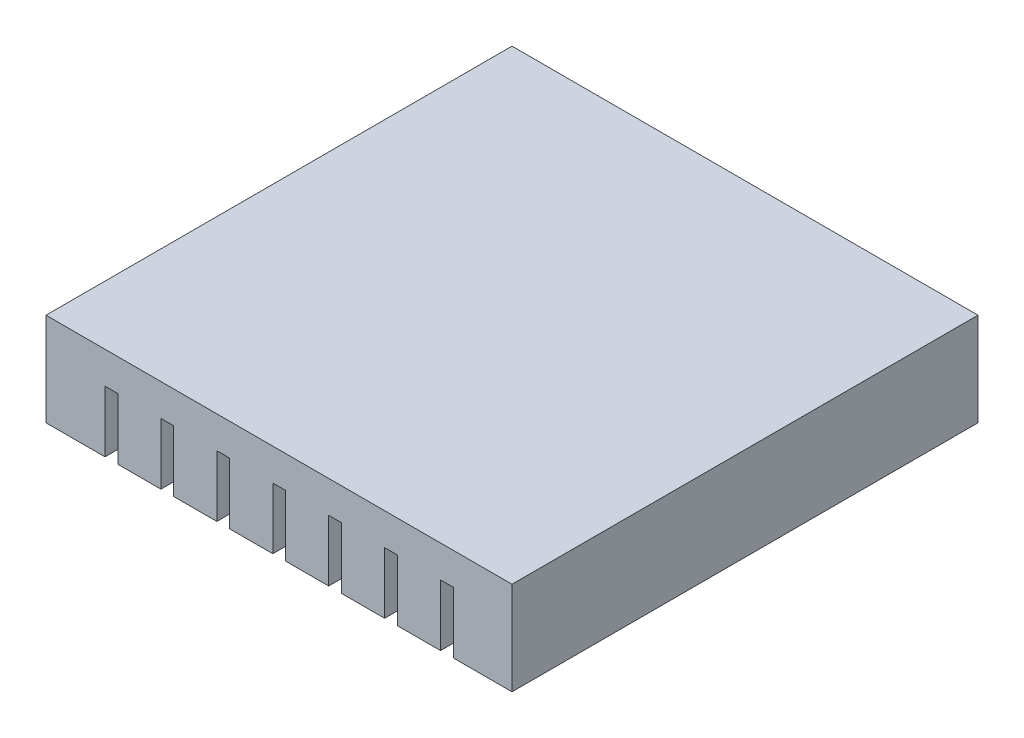
ISO-10303-21;
HEADER;
FILE_DESCRIPTION(('STEP AP214'),'2;1');
FILE_NAME('part.step','',(''),(''),'','','');
FILE_SCHEMA(('AUTOMOTIVE_DESIGN { 1 0 10303 214 1 1 1 1 }'));
ENDSEC;
DATA;
#1=APPLICATION_CONTEXT('core data for automotive mechanical design processes');
#2=APPLICATION_PROTOCOL_DEFINITION('international standard','automotive_design',2000,#1);
#3=PRODUCT_CONTEXT('',#1,'mechanical');
#4=PRODUCT('Part','Part','',(#3));
#5=PRODUCT_RELATED_PRODUCT_CATEGORY('part','',(#4));
#6=PRODUCT_DEFINITION_FORMATION('','',#4);
#7=PRODUCT_DEFINITION_CONTEXT('part definition',#1,'design');
#8=PRODUCT_DEFINITION('design','',#6,#7);
#9=PRODUCT_DEFINITION_SHAPE('','',#8);
#10=(LENGTH_UNIT() NAMED_UNIT(*) SI_UNIT(.MILLI.,.METRE.));
#11=(NAMED_UNIT(*) PLANE_ANGLE_UNIT() SI_UNIT($,.RADIAN.));
#12=(NAMED_UNIT(*) SI_UNIT($,.STERADIAN.) SOLID_ANGLE_UNIT());
#13=UNCERTAINTY_MEASURE_WITH_UNIT(LENGTH_MEASURE(1.E-05),#10,'distance_accuracy_value','');
#14=(GEOMETRIC_REPRESENTATION_CONTEXT(3) GLOBAL_UNCERTAINTY_ASSIGNED_CONTEXT((#13)) GLOBAL_UNIT_ASSIGNED_CONTEXT((#10,
#11,#12)) REPRESENTATION_CONTEXT('',''));
#15=CARTESIAN_POINT('',(0.,0.,0.));
#16=DIRECTION('',(0.,0.,1.));
#17=DIRECTION('',(1.,0.,0.));
#18=AXIS2_PLACEMENT_3D('',#15,#16,#17);
#19=CARTESIAN_POINT('',(0.,0.,0.));
#20=DIRECTION('',(0.,1.,0.));
#21=DIRECTION('',(0.,0.,1.));
#22=AXIS2_PLACEMENT_3D('',#19,#20,#21);
#23=PLANE('',#22);
#24=DIRECTION('',(-1.,0.,0.));
#25=VECTOR('',#24,1.);
#26=CARTESIAN_POINT('',(0.,0.,0.));
#27=LINE('',#26,#25);
#28=CARTESIAN_POINT('',(12.3309619154796,0.,0.));
#29=VERTEX_POINT('',#28);
#30=CARTESIAN_POINT('',(7.70096191547959,0.,0.));
#31=VERTEX_POINT('',#30);
#32=EDGE_CURVE('E262',#29,#31,#27,.T.);
#33=ORIENTED_EDGE('',*,*,#32,.F.);
#34=DIRECTION('',(0.,0.,1.));
#35=VECTOR('',#34,1.);
#36=CARTESIAN_POINT('',(12.3309619154796,0.,-6.71010906606882));
#37=LINE('',#36,#35);
#38=CARTESIAN_POINT('',(12.3309619154796,0.,50.));
#39=VERTEX_POINT('',#38);
#40=EDGE_CURVE('E246',#29,#39,#37,.T.);
#41=ORIENTED_EDGE('',*,*,#40,.T.);
#42=DIRECTION('',(1.,0.,0.));
#43=VECTOR('',#42,1.);
#44=CARTESIAN_POINT('',(0.,0.,50.));
#45=LINE('',#44,#43);
#46=CARTESIAN_POINT('',(7.70096191547959,0.,50.));
#47=VERTEX_POINT('',#46);
#48=EDGE_CURVE('E261',#47,#39,#45,.T.);
#49=ORIENTED_EDGE('',*,*,#48,.F.);
#50=DIRECTION('',(0.,0.,1.));
#51=VECTOR('',#50,1.);
#52=CARTESIAN_POINT('',(7.70096191547959,0.,-6.71010906606882));
#53=LINE('',#52,#51);
#54=EDGE_CURVE('E329',#31,#47,#53,.T.);
#55=ORIENTED_EDGE('',*,*,#54,.F.);
#56=EDGE_LOOP('',(#33,#41,#49,#55));
#57=FACE_BOUND('',#56,.T.);
#58=ADVANCED_FACE('F33',(#57),#23,.F.);
#59=CARTESIAN_POINT('',(13.7009619154796,0.,50.));
#60=VERTEX_POINT('',#59);
#61=CARTESIAN_POINT('',(18.3309619154796,0.,50.));
#62=VERTEX_POINT('',#61);
#63=EDGE_CURVE('E272',#60,#62,#45,.T.);
#64=ORIENTED_EDGE('',*,*,#63,.F.);
#65=DIRECTION('',(0.,0.,1.));
#66=VECTOR('',#65,1.);
#67=CARTESIAN_POINT('',(13.7009619154796,0.,-6.71010906606882));
#68=LINE('',#67,#66);
#69=CARTESIAN_POINT('',(13.7009619154796,0.,0.));
#70=VERTEX_POINT('',#69);
#71=EDGE_CURVE('E263',#70,#60,#68,.T.);
#72=ORIENTED_EDGE('',*,*,#71,.F.);
#73=CARTESIAN_POINT('',(18.3309619154796,0.,0.));
#74=VERTEX_POINT('',#73);
#75=EDGE_CURVE('E477',#74,#70,#27,.T.);
#76=ORIENTED_EDGE('',*,*,#75,.F.);
#77=DIRECTION('',(0.,0.,1.));
#78=VECTOR('',#77,1.);
#79=CARTESIAN_POINT('',(18.3309619154796,0.,-6.71010906606882));
#80=LINE('',#79,#78);
#81=EDGE_CURVE('E440',#74,#62,#80,.T.);
#82=ORIENTED_EDGE('',*,*,#81,.T.);
#83=EDGE_LOOP('',(#64,#72,#76,#82));
#84=FACE_BOUND('',#83,.T.);
#85=ADVANCED_FACE('F534',(#84),#23,.F.);
#86=CARTESIAN_POINT('',(19.7009619154796,0.,50.));
#87=VERTEX_POINT('',#86);
#88=CARTESIAN_POINT('',(24.3309619154796,0.,50.));
#89=VERTEX_POINT('',#88);
#90=EDGE_CURVE('E278',#87,#89,#45,.T.);
#91=ORIENTED_EDGE('',*,*,#90,.F.);
#92=DIRECTION('',(0.,0.,1.));
#93=VECTOR('',#92,1.);
#94=CARTESIAN_POINT('',(19.7009619154796,0.,-6.71010906606882));
#95=LINE('',#94,#93);
#96=CARTESIAN_POINT('',(19.7009619154796,0.,0.));
#97=VERTEX_POINT('',#96);
#98=EDGE_CURVE('E443',#97,#87,#95,.T.);
#99=ORIENTED_EDGE('',*,*,#98,.F.);
#100=CARTESIAN_POINT('',(24.3309619154796,0.,0.));
#101=VERTEX_POINT('',#100);
#102=EDGE_CURVE('E480',#101,#97,#27,.T.);
#103=ORIENTED_EDGE('',*,*,#102,.F.);
#104=DIRECTION('',(0.,0.,1.));
#105=VECTOR('',#104,1.);
#106=CARTESIAN_POINT('',(24.3309619154796,0.,-6.71010906606882));
#107=LINE('',#106,#105);
#108=EDGE_CURVE('E417',#101,#89,#107,.T.);
#109=ORIENTED_EDGE('',*,*,#108,.T.);
#110=EDGE_LOOP('',(#91,#99,#103,#109));
#111=FACE_BOUND('',#110,.T.);
#112=ADVANCED_FACE('F523',(#111),#23,.F.);
#113=CARTESIAN_POINT('',(25.7009619154796,0.,50.));
#114=VERTEX_POINT('',#113);
#115=CARTESIAN_POINT('',(30.3309619154796,0.,50.));
#116=VERTEX_POINT('',#115);
#117=EDGE_CURVE('E506',#114,#116,#45,.T.);
#118=ORIENTED_EDGE('',*,*,#117,.F.);
#119=DIRECTION('',(0.,0.,1.));
#120=VECTOR('',#119,1.);
#121=CARTESIAN_POINT('',(25.7009619154796,0.,-6.71010906606882));
#122=LINE('',#121,#120);
#123=CARTESIAN_POINT('',(25.7009619154796,0.,0.));
#124=VERTEX_POINT('',#123);
#125=EDGE_CURVE('E420',#124,#114,#122,.T.);
#126=ORIENTED_EDGE('',*,*,#125,.F.);
#127=CARTESIAN_POINT('',(30.3309619154796,0.,0.));
#128=VERTEX_POINT('',#127);
#129=EDGE_CURVE('E482',#128,#124,#27,.T.);
#130=ORIENTED_EDGE('',*,*,#129,.F.);
#131=DIRECTION('',(0.,0.,1.));
#132=VECTOR('',#131,1.);
#133=CARTESIAN_POINT('',(30.3309619154796,0.,-6.71010906606882));
#134=LINE('',#133,#132);
#135=EDGE_CURVE('E394',#128,#116,#134,.T.);
#136=ORIENTED_EDGE('',*,*,#135,.T.);
#137=EDGE_LOOP('',(#118,#126,#130,#136));
#138=FACE_BOUND('',#137,.T.);
#139=ADVANCED_FACE('F504',(#138),#23,.F.);
#140=CARTESIAN_POINT('',(31.7009619154796,0.,50.));
#141=VERTEX_POINT('',#140);
#142=CARTESIAN_POINT('',(36.3309619154796,0.,50.));
#143=VERTEX_POINT('',#142);
#144=EDGE_CURVE('E567',#141,#143,#45,.T.);
#145=ORIENTED_EDGE('',*,*,#144,.F.);
#146=DIRECTION('',(0.,0.,1.));
#147=VECTOR('',#146,1.);
#148=CARTESIAN_POINT('',(31.7009619154796,0.,-6.71010906606882));
#149=LINE('',#148,#147);
#150=CARTESIAN_POINT('',(31.7009619154796,0.,0.));
#151=VERTEX_POINT('',#150);
#152=EDGE_CURVE('E397',#151,#141,#149,.T.);
#153=ORIENTED_EDGE('',*,*,#152,.F.);
#154=CARTESIAN_POINT('',(36.3309619154796,0.,0.));
#155=VERTEX_POINT('',#154);
#156=EDGE_CURVE('E487',#155,#151,#27,.T.);
#157=ORIENTED_EDGE('',*,*,#156,.F.);
#158=DIRECTION('',(0.,0.,1.));
#159=VECTOR('',#158,1.);
#160=CARTESIAN_POINT('',(36.3309619154796,0.,-6.71010906606882));
#161=LINE('',#160,#159);
#162=EDGE_CURVE('E371',#155,#143,#161,.T.);
#163=ORIENTED_EDGE('',*,*,#162,.T.);
#164=EDGE_LOOP('',(#145,#153,#157,#163));
#165=FACE_BOUND('',#164,.T.);
#166=ADVANCED_FACE('F579',(#165),#23,.F.);
#167=CARTESIAN_POINT('',(37.7009619154796,0.,50.));
#168=VERTEX_POINT('',#167);
#169=CARTESIAN_POINT('',(42.3309619154796,0.,50.));
#170=VERTEX_POINT('',#169);
#171=EDGE_CURVE('E564',#168,#170,#45,.T.);
#172=ORIENTED_EDGE('',*,*,#171,.F.);
#173=DIRECTION('',(0.,0.,1.));
#174=VECTOR('',#173,1.);
#175=CARTESIAN_POINT('',(37.7009619154796,0.,-6.71010906606882));
#176=LINE('',#175,#174);
#177=CARTESIAN_POINT('',(37.7009619154796,0.,0.));
#178=VERTEX_POINT('',#177);
#179=EDGE_CURVE('E374',#178,#168,#176,.T.);
#180=ORIENTED_EDGE('',*,*,#179,.F.);
#181=CARTESIAN_POINT('',(42.3309619154796,0.,0.));
#182=VERTEX_POINT('',#181);
#183=EDGE_CURVE('E289',#182,#178,#27,.T.);
#184=ORIENTED_EDGE('',*,*,#183,.F.);
#185=DIRECTION('',(0.,0.,1.));
#186=VECTOR('',#185,1.);
#187=CARTESIAN_POINT('',(42.3309619154796,0.,-6.71010906606882));
#188=LINE('',#187,#186);
#189=EDGE_CURVE('E349',#182,#170,#188,.T.);
#190=ORIENTED_EDGE('',*,*,#189,.T.);
#191=EDGE_LOOP('',(#172,#180,#184,#190));
#192=FACE_BOUND('',#191,.T.);
#193=ADVANCED_FACE('F559',(#192),#23,.F.);
#194=CARTESIAN_POINT('',(6.33096191547959,0.,0.));
#195=VERTEX_POINT('',#194);
#196=CARTESIAN_POINT('',(0.,0.,0.));
#197=VERTEX_POINT('',#196);
#198=EDGE_CURVE('E284',#195,#197,#27,.T.);
#199=ORIENTED_EDGE('',*,*,#198,.F.);
#200=DIRECTION('',(0.,0.,1.));
#201=VECTOR('',#200,1.);
#202=CARTESIAN_POINT('',(6.33096191547959,0.,-6.71010906606882));
#203=LINE('',#202,#201);
#204=CARTESIAN_POINT('',(6.33096191547959,0.,50.));
#205=VERTEX_POINT('',#204);
#206=EDGE_CURVE('E326',#195,#205,#203,.T.);
#207=ORIENTED_EDGE('',*,*,#206,.T.);
#208=CARTESIAN_POINT('',(0.,0.,50.));
#209=VERTEX_POINT('',#208);
#210=EDGE_CURVE('E271',#209,#205,#45,.T.);
#211=ORIENTED_EDGE('',*,*,#210,.F.);
#212=DIRECTION('',(0.,0.,1.));
#213=VECTOR('',#212,1.);
#214=CARTESIAN_POINT('',(0.,0.,0.));
#215=LINE('',#214,#213);
#216=EDGE_CURVE('E281',#197,#209,#215,.T.);
#217=ORIENTED_EDGE('',*,*,#216,.F.);
#218=EDGE_LOOP('',(#199,#207,#211,#217));
#219=FACE_BOUND('',#218,.T.);
#220=ADVANCED_FACE('F546',(#219),#23,.F.);
#221=CARTESIAN_POINT('',(0.,10.,0.));
#222=DIRECTION('',(1.,0.,0.));
#223=DIRECTION('',(0.,0.,-1.));
#224=AXIS2_PLACEMENT_3D('',#221,#222,#223);
#225=PLANE('',#224);
#226=ORIENTED_EDGE('',*,*,#216,.T.);
#227=DIRECTION('',(0.,-1.,0.));
#228=VECTOR('',#227,1.);
#229=CARTESIAN_POINT('',(0.,10.,50.));
#230=LINE('',#229,#228);
#231=CARTESIAN_POINT('',(0.,10.,50.));
#232=VERTEX_POINT('',#231);
#233=EDGE_CURVE('E11',#232,#209,#230,.T.);
#234=ORIENTED_EDGE('',*,*,#233,.F.);
#235=DIRECTION('',(0.,0.,1.));
#236=VECTOR('',#235,1.);
#237=CARTESIAN_POINT('',(0.,10.,0.));
#238=LINE('',#237,#236);
#239=CARTESIAN_POINT('',(0.,10.,0.));
#240=VERTEX_POINT('',#239);
#241=EDGE_CURVE('E288',#240,#232,#238,.T.);
#242=ORIENTED_EDGE('',*,*,#241,.F.);
#243=DIRECTION('',(0.,-1.,0.));
#244=VECTOR('',#243,1.);
#245=CARTESIAN_POINT('',(0.,10.,0.));
#246=LINE('',#245,#244);
#247=EDGE_CURVE('E290',#240,#197,#246,.T.);
#248=ORIENTED_EDGE('',*,*,#247,.T.);
#249=EDGE_LOOP('',(#226,#234,#242,#248));
#250=FACE_BOUND('',#249,.T.);
#251=ADVANCED_FACE('F35',(#250),#225,.F.);
#252=CARTESIAN_POINT('',(0.,10.,50.));
#253=DIRECTION('',(0.,0.,-1.));
#254=DIRECTION('',(-1.,0.,0.));
#255=AXIS2_PLACEMENT_3D('',#252,#253,#254);
#256=PLANE('',#255);
#257=ORIENTED_EDGE('',*,*,#48,.T.);
#258=DIRECTION('',(0.,-1.,0.));
#259=VECTOR('',#258,1.);
#260=CARTESIAN_POINT('',(12.3309619154796,0.,50.));
#261=LINE('',#260,#259);
#262=CARTESIAN_POINT('',(12.3309619154796,6.56876424288001,50.));
#263=VERTEX_POINT('',#262);
#264=EDGE_CURVE('E243',#263,#39,#261,.T.);
#265=ORIENTED_EDGE('',*,*,#264,.F.);
#266=DIRECTION('',(-1.,0.,0.));
#267=VECTOR('',#266,1.);
#268=CARTESIAN_POINT('',(12.3309619154796,6.56876424288001,50.));
#269=LINE('',#268,#267);
#270=CARTESIAN_POINT('',(13.7009619154796,6.56876424288001,50.));
#271=VERTEX_POINT('',#270);
#272=EDGE_CURVE('E264',#271,#263,#269,.T.);
#273=ORIENTED_EDGE('',*,*,#272,.F.);
#274=DIRECTION('',(0.,1.,0.));
#275=VECTOR('',#274,1.);
#276=CARTESIAN_POINT('',(13.7009619154796,0.,50.));
#277=LINE('',#276,#275);
#278=EDGE_CURVE('E254',#60,#271,#277,.T.);
#279=ORIENTED_EDGE('',*,*,#278,.F.);
#280=ORIENTED_EDGE('',*,*,#63,.T.);
#281=DIRECTION('',(0.,-1.,0.));
#282=VECTOR('',#281,1.);
#283=CARTESIAN_POINT('',(18.3309619154796,0.,50.));
#284=LINE('',#283,#282);
#285=CARTESIAN_POINT('',(18.3309619154796,6.56876424288001,50.));
#286=VERTEX_POINT('',#285);
#287=EDGE_CURVE('E436',#286,#62,#284,.T.);
#288=ORIENTED_EDGE('',*,*,#287,.F.);
#289=DIRECTION('',(-1.,0.,0.));
#290=VECTOR('',#289,1.);
#291=CARTESIAN_POINT('',(18.3309619154796,6.56876424288001,50.));
#292=LINE('',#291,#290);
#293=CARTESIAN_POINT('',(19.7009619154796,6.56876424288001,50.));
#294=VERTEX_POINT('',#293);
#295=EDGE_CURVE('E444',#294,#286,#292,.T.);
#296=ORIENTED_EDGE('',*,*,#295,.F.);
#297=DIRECTION('',(0.,1.,0.));
#298=VECTOR('',#297,1.);
#299=CARTESIAN_POINT('',(19.7009619154796,0.,50.));
#300=LINE('',#299,#298);
#301=EDGE_CURVE('E452',#87,#294,#300,.T.);
#302=ORIENTED_EDGE('',*,*,#301,.F.);
#303=ORIENTED_EDGE('',*,*,#90,.T.);
#304=DIRECTION('',(0.,-1.,0.));
#305=VECTOR('',#304,1.);
#306=CARTESIAN_POINT('',(24.3309619154796,0.,50.));
#307=LINE('',#306,#305);
#308=CARTESIAN_POINT('',(24.3309619154796,6.56876424288001,50.));
#309=VERTEX_POINT('',#308);
#310=EDGE_CURVE('E413',#309,#89,#307,.T.);
#311=ORIENTED_EDGE('',*,*,#310,.F.);
#312=DIRECTION('',(-1.,0.,0.));
#313=VECTOR('',#312,1.);
#314=CARTESIAN_POINT('',(24.3309619154796,6.56876424288001,50.));
#315=LINE('',#314,#313);
#316=CARTESIAN_POINT('',(25.7009619154796,6.56876424288001,50.));
#317=VERTEX_POINT('',#316);
#318=EDGE_CURVE('E421',#317,#309,#315,.T.);
#319=ORIENTED_EDGE('',*,*,#318,.F.);
#320=DIRECTION('',(0.,1.,0.));
#321=VECTOR('',#320,1.);
#322=CARTESIAN_POINT('',(25.7009619154796,0.,50.));
#323=LINE('',#322,#321);
#324=EDGE_CURVE('E430',#114,#317,#323,.T.);
#325=ORIENTED_EDGE('',*,*,#324,.F.);
#326=ORIENTED_EDGE('',*,*,#117,.T.);
#327=DIRECTION('',(0.,-1.,0.));
#328=VECTOR('',#327,1.);
#329=CARTESIAN_POINT('',(30.3309619154796,0.,50.));
#330=LINE('',#329,#328);
#331=CARTESIAN_POINT('',(30.3309619154796,6.56876424288001,50.));
#332=VERTEX_POINT('',#331);
#333=EDGE_CURVE('E390',#332,#116,#330,.T.);
#334=ORIENTED_EDGE('',*,*,#333,.F.);
#335=DIRECTION('',(-1.,0.,0.));
#336=VECTOR('',#335,1.);
#337=CARTESIAN_POINT('',(30.3309619154796,6.56876424288001,50.));
#338=LINE('',#337,#336);
#339=CARTESIAN_POINT('',(31.7009619154796,6.56876424288001,50.));
#340=VERTEX_POINT('',#339);
#341=EDGE_CURVE('E398',#340,#332,#338,.T.);
#342=ORIENTED_EDGE('',*,*,#341,.F.);
#343=DIRECTION('',(0.,1.,0.));
#344=VECTOR('',#343,1.);
#345=CARTESIAN_POINT('',(31.7009619154796,0.,50.));
#346=LINE('',#345,#344);
#347=EDGE_CURVE('E407',#141,#340,#346,.T.);
#348=ORIENTED_EDGE('',*,*,#347,.F.);
#349=ORIENTED_EDGE('',*,*,#144,.T.);
#350=DIRECTION('',(0.,-1.,0.));
#351=VECTOR('',#350,1.);
#352=CARTESIAN_POINT('',(36.3309619154796,0.,50.));
#353=LINE('',#352,#351);
#354=CARTESIAN_POINT('',(36.3309619154796,6.56876424288001,50.));
#355=VERTEX_POINT('',#354);
#356=EDGE_CURVE('E367',#355,#143,#353,.T.);
#357=ORIENTED_EDGE('',*,*,#356,.F.);
#358=DIRECTION('',(-1.,0.,0.));
#359=VECTOR('',#358,1.);
#360=CARTESIAN_POINT('',(36.3309619154796,6.56876424288001,50.));
#361=LINE('',#360,#359);
#362=CARTESIAN_POINT('',(37.7009619154796,6.56876424288001,50.));
#363=VERTEX_POINT('',#362);
#364=EDGE_CURVE('E375',#363,#355,#361,.T.);
#365=ORIENTED_EDGE('',*,*,#364,.F.);
#366=DIRECTION('',(0.,1.,0.));
#367=VECTOR('',#366,1.);
#368=CARTESIAN_POINT('',(37.7009619154796,0.,50.));
#369=LINE('',#368,#367);
#370=EDGE_CURVE('E384',#168,#363,#369,.T.);
#371=ORIENTED_EDGE('',*,*,#370,.F.);
#372=ORIENTED_EDGE('',*,*,#171,.T.);
#373=DIRECTION('',(0.,-1.,0.));
#374=VECTOR('',#373,1.);
#375=CARTESIAN_POINT('',(42.3309619154796,0.,50.));
#376=LINE('',#375,#374);
#377=CARTESIAN_POINT('',(42.3309619154796,6.56876424288001,50.));
#378=VERTEX_POINT('',#377);
#379=EDGE_CURVE('E363',#378,#170,#376,.T.);
#380=ORIENTED_EDGE('',*,*,#379,.F.);
#381=DIRECTION('',(-1.,0.,0.));
#382=VECTOR('',#381,1.);
#383=CARTESIAN_POINT('',(42.3309619154796,6.56876424288001,50.));
#384=LINE('',#383,#382);
#385=CARTESIAN_POINT('',(43.7009619154796,6.56876424288001,50.));
#386=VERTEX_POINT('',#385);
#387=EDGE_CURVE('E352',#386,#378,#384,.T.);
#388=ORIENTED_EDGE('',*,*,#387,.F.);
#389=DIRECTION('',(0.,1.,0.));
#390=VECTOR('',#389,1.);
#391=CARTESIAN_POINT('',(43.7009619154796,0.,50.));
#392=LINE('',#391,#390);
#393=CARTESIAN_POINT('',(43.7009619154796,0.,50.));
#394=VERTEX_POINT('',#393);
#395=EDGE_CURVE('E360',#394,#386,#392,.T.);
#396=ORIENTED_EDGE('',*,*,#395,.F.);
#397=CARTESIAN_POINT('',(50.,0.,50.));
#398=VERTEX_POINT('',#397);
#399=EDGE_CURVE('E276',#394,#398,#45,.T.);
#400=ORIENTED_EDGE('',*,*,#399,.T.);
#401=DIRECTION('',(0.,-1.,0.));
#402=VECTOR('',#401,1.);
#403=CARTESIAN_POINT('',(50.,10.,50.));
#404=LINE('',#403,#402);
#405=CARTESIAN_POINT('',(50.,10.,50.));
#406=VERTEX_POINT('',#405);
#407=EDGE_CURVE('E41',#406,#398,#404,.T.);
#408=ORIENTED_EDGE('',*,*,#407,.F.);
#409=DIRECTION('',(1.,0.,0.));
#410=VECTOR('',#409,1.);
#411=CARTESIAN_POINT('',(0.,10.,50.));
#412=LINE('',#411,#410);
#413=EDGE_CURVE('E321',#232,#406,#412,.T.);
#414=ORIENTED_EDGE('',*,*,#413,.F.);
#415=ORIENTED_EDGE('',*,*,#233,.T.);
#416=ORIENTED_EDGE('',*,*,#210,.T.);
#417=DIRECTION('',(0.,-1.,0.));
#418=VECTOR('',#417,1.);
#419=CARTESIAN_POINT('',(6.33096191547959,0.,50.));
#420=LINE('',#419,#418);
#421=CARTESIAN_POINT('',(6.33096191547959,6.56876424288001,50.));
#422=VERTEX_POINT('',#421);
#423=EDGE_CURVE('E340',#422,#205,#420,.T.);
#424=ORIENTED_EDGE('',*,*,#423,.F.);
#425=DIRECTION('',(-1.,0.,0.));
#426=VECTOR('',#425,1.);
#427=CARTESIAN_POINT('',(6.33096191547959,6.56876424288001,50.));
#428=LINE('',#427,#426);
#429=CARTESIAN_POINT('',(7.70096191547959,6.56876424288001,50.));
#430=VERTEX_POINT('',#429);
#431=EDGE_CURVE('E330',#430,#422,#428,.T.);
#432=ORIENTED_EDGE('',*,*,#431,.F.);
#433=DIRECTION('',(0.,1.,0.));
#434=VECTOR('',#433,1.);
#435=CARTESIAN_POINT('',(7.70096191547959,0.,50.));
#436=LINE('',#435,#434);
#437=EDGE_CURVE('E270',#47,#430,#436,.T.);
#438=ORIENTED_EDGE('',*,*,#437,.F.);
#439=EDGE_LOOP('',(#257,#265,#273,#279,#280,#288,#296,#302,#303,#311,#319,#325,#326,#334,#342,
#348,#349,#357,#365,#371,#372,#380,#388,#396,#400,#408,#414,#415,#416,#424,#432,#438));
#440=FACE_BOUND('',#439,.T.);
#441=ADVANCED_FACE('F267',(#440),#256,.F.);
#442=CARTESIAN_POINT('',(50.,10.,0.));
#443=DIRECTION('',(-1.,0.,0.));
#444=DIRECTION('',(0.,0.,1.));
#445=AXIS2_PLACEMENT_3D('',#442,#443,#444);
#446=PLANE('',#445);
#447=DIRECTION('',(0.,0.,-1.));
#448=VECTOR('',#447,1.);
#449=CARTESIAN_POINT('',(50.,0.,0.));
#450=LINE('',#449,#448);
#451=CARTESIAN_POINT('',(50.,0.,0.));
#452=VERTEX_POINT('',#451);
#453=EDGE_CURVE('E275',#398,#452,#450,.T.);
#454=ORIENTED_EDGE('',*,*,#453,.T.);
#455=DIRECTION('',(0.,-1.,0.));
#456=VECTOR('',#455,1.);
#457=CARTESIAN_POINT('',(50.,10.,0.));
#458=LINE('',#457,#456);
#459=CARTESIAN_POINT('',(50.,10.,0.));
#460=VERTEX_POINT('',#459);
#461=EDGE_CURVE('E293',#460,#452,#458,.T.);
#462=ORIENTED_EDGE('',*,*,#461,.F.);
#463=DIRECTION('',(0.,0.,-1.));
#464=VECTOR('',#463,1.);
#465=CARTESIAN_POINT('',(50.,10.,0.));
#466=LINE('',#465,#464);
#467=EDGE_CURVE('E303',#406,#460,#466,.T.);
#468=ORIENTED_EDGE('',*,*,#467,.F.);
#469=ORIENTED_EDGE('',*,*,#407,.T.);
#470=EDGE_LOOP('',(#454,#462,#468,#469));
#471=FACE_BOUND('',#470,.T.);
#472=ADVANCED_FACE('F301',(#471),#446,.F.);
#473=CARTESIAN_POINT('',(0.,10.,0.));
#474=DIRECTION('',(0.,0.,1.));
#475=DIRECTION('',(1.,0.,0.));
#476=AXIS2_PLACEMENT_3D('',#473,#474,#475);
#477=PLANE('',#476);
#478=DIRECTION('',(1.,0.,0.));
#479=VECTOR('',#478,1.);
#480=CARTESIAN_POINT('',(12.3309619154796,6.56876424288001,0.));
#481=LINE('',#480,#479);
#482=CARTESIAN_POINT('',(12.3309619154796,6.56876424288001,0.));
#483=VERTEX_POINT('',#482);
#484=CARTESIAN_POINT('',(13.7009619154796,6.56876424288001,0.));
#485=VERTEX_POINT('',#484);
#486=EDGE_CURVE('E468',#483,#485,#481,.T.);
#487=ORIENTED_EDGE('',*,*,#486,.F.);
#488=DIRECTION('',(0.,1.,0.));
#489=VECTOR('',#488,1.);
#490=CARTESIAN_POINT('',(12.3309619154796,0.,0.));
#491=LINE('',#490,#489);
#492=EDGE_CURVE('E342',#29,#483,#491,.T.);
#493=ORIENTED_EDGE('',*,*,#492,.F.);
#494=ORIENTED_EDGE('',*,*,#32,.T.);
#495=DIRECTION('',(0.,-1.,0.));
#496=VECTOR('',#495,1.);
#497=CARTESIAN_POINT('',(7.70096191547959,0.,0.));
#498=LINE('',#497,#496);
#499=CARTESIAN_POINT('',(7.70096191547959,6.56876424288001,0.));
#500=VERTEX_POINT('',#499);
#501=EDGE_CURVE('E336',#500,#31,#498,.T.);
#502=ORIENTED_EDGE('',*,*,#501,.F.);
#503=DIRECTION('',(1.,0.,0.));
#504=VECTOR('',#503,1.);
#505=CARTESIAN_POINT('',(6.33096191547959,6.56876424288001,0.));
#506=LINE('',#505,#504);
#507=CARTESIAN_POINT('',(6.33096191547959,6.56876424288001,0.));
#508=VERTEX_POINT('',#507);
#509=EDGE_CURVE('E345',#508,#500,#506,.T.);
#510=ORIENTED_EDGE('',*,*,#509,.F.);
#511=DIRECTION('',(0.,1.,0.));
#512=VECTOR('',#511,1.);
#513=CARTESIAN_POINT('',(6.33096191547959,0.,0.));
#514=LINE('',#513,#512);
#515=EDGE_CURVE('E343',#195,#508,#514,.T.);
#516=ORIENTED_EDGE('',*,*,#515,.F.);
#517=ORIENTED_EDGE('',*,*,#198,.T.);
#518=ORIENTED_EDGE('',*,*,#247,.F.);
#519=DIRECTION('',(-1.,0.,0.));
#520=VECTOR('',#519,1.);
#521=CARTESIAN_POINT('',(0.,10.,0.));
#522=LINE('',#521,#520);
#523=EDGE_CURVE('E294',#460,#240,#522,.T.);
#524=ORIENTED_EDGE('',*,*,#523,.F.);
#525=ORIENTED_EDGE('',*,*,#461,.T.);
#526=CARTESIAN_POINT('',(43.7009619154796,0.,0.));
#527=VERTEX_POINT('',#526);
#528=EDGE_CURVE('E285',#452,#527,#27,.T.);
#529=ORIENTED_EDGE('',*,*,#528,.T.);
#530=DIRECTION('',(0.,-1.,0.));
#531=VECTOR('',#530,1.);
#532=CARTESIAN_POINT('',(43.7009619154796,0.,0.));
#533=LINE('',#532,#531);
#534=CARTESIAN_POINT('',(43.7009619154796,6.56876424288001,0.));
#535=VERTEX_POINT('',#534);
#536=EDGE_CURVE('E315',#535,#527,#533,.T.);
#537=ORIENTED_EDGE('',*,*,#536,.F.);
#538=DIRECTION('',(1.,0.,0.));
#539=VECTOR('',#538,1.);
#540=CARTESIAN_POINT('',(42.3309619154796,6.56876424288001,0.));
#541=LINE('',#540,#539);
#542=CARTESIAN_POINT('',(42.3309619154796,6.56876424288001,0.));
#543=VERTEX_POINT('',#542);
#544=EDGE_CURVE('E368',#543,#535,#541,.T.);
#545=ORIENTED_EDGE('',*,*,#544,.F.);
#546=DIRECTION('',(0.,1.,0.));
#547=VECTOR('',#546,1.);
#548=CARTESIAN_POINT('',(42.3309619154796,0.,0.));
#549=LINE('',#548,#547);
#550=EDGE_CURVE('E365',#182,#543,#549,.T.);
#551=ORIENTED_EDGE('',*,*,#550,.F.);
#552=ORIENTED_EDGE('',*,*,#183,.T.);
#553=DIRECTION('',(0.,-1.,0.));
#554=VECTOR('',#553,1.);
#555=CARTESIAN_POINT('',(37.7009619154796,0.,0.));
#556=LINE('',#555,#554);
#557=CARTESIAN_POINT('',(37.7009619154796,6.56876424288001,0.));
#558=VERTEX_POINT('',#557);
#559=EDGE_CURVE('E381',#558,#178,#556,.T.);
#560=ORIENTED_EDGE('',*,*,#559,.F.);
#561=DIRECTION('',(1.,0.,0.));
#562=VECTOR('',#561,1.);
#563=CARTESIAN_POINT('',(36.3309619154796,6.56876424288001,0.));
#564=LINE('',#563,#562);
#565=CARTESIAN_POINT('',(36.3309619154796,6.56876424288001,0.));
#566=VERTEX_POINT('',#565);
#567=EDGE_CURVE('E391',#566,#558,#564,.T.);
#568=ORIENTED_EDGE('',*,*,#567,.F.);
#569=DIRECTION('',(0.,1.,0.));
#570=VECTOR('',#569,1.);
#571=CARTESIAN_POINT('',(36.3309619154796,0.,0.));
#572=LINE('',#571,#570);
#573=EDGE_CURVE('E388',#155,#566,#572,.T.);
#574=ORIENTED_EDGE('',*,*,#573,.F.);
#575=ORIENTED_EDGE('',*,*,#156,.T.);
#576=DIRECTION('',(0.,-1.,0.));
#577=VECTOR('',#576,1.);
#578=CARTESIAN_POINT('',(31.7009619154796,0.,0.));
#579=LINE('',#578,#577);
#580=CARTESIAN_POINT('',(31.7009619154796,6.56876424288001,0.));
#581=VERTEX_POINT('',#580);
#582=EDGE_CURVE('E404',#581,#151,#579,.T.);
#583=ORIENTED_EDGE('',*,*,#582,.F.);
#584=DIRECTION('',(1.,0.,0.));
#585=VECTOR('',#584,1.);
#586=CARTESIAN_POINT('',(30.3309619154796,6.56876424288001,0.));
#587=LINE('',#586,#585);
#588=CARTESIAN_POINT('',(30.3309619154796,6.56876424288001,0.));
#589=VERTEX_POINT('',#588);
#590=EDGE_CURVE('E414',#589,#581,#587,.T.);
#591=ORIENTED_EDGE('',*,*,#590,.F.);
#592=DIRECTION('',(0.,1.,0.));
#593=VECTOR('',#592,1.);
#594=CARTESIAN_POINT('',(30.3309619154796,0.,0.));
#595=LINE('',#594,#593);
#596=EDGE_CURVE('E411',#128,#589,#595,.T.);
#597=ORIENTED_EDGE('',*,*,#596,.F.);
#598=ORIENTED_EDGE('',*,*,#129,.T.);
#599=DIRECTION('',(0.,-1.,0.));
#600=VECTOR('',#599,1.);
#601=CARTESIAN_POINT('',(25.7009619154796,0.,0.));
#602=LINE('',#601,#600);
#603=CARTESIAN_POINT('',(25.7009619154796,6.56876424288001,0.));
#604=VERTEX_POINT('',#603);
#605=EDGE_CURVE('E427',#604,#124,#602,.T.);
#606=ORIENTED_EDGE('',*,*,#605,.F.);
#607=DIRECTION('',(1.,0.,0.));
#608=VECTOR('',#607,1.);
#609=CARTESIAN_POINT('',(24.3309619154796,6.56876424288001,0.));
#610=LINE('',#609,#608);
#611=CARTESIAN_POINT('',(24.3309619154796,6.56876424288001,0.));
#612=VERTEX_POINT('',#611);
#613=EDGE_CURVE('E437',#612,#604,#610,.T.);
#614=ORIENTED_EDGE('',*,*,#613,.F.);
#615=DIRECTION('',(0.,1.,0.));
#616=VECTOR('',#615,1.);
#617=CARTESIAN_POINT('',(24.3309619154796,0.,0.));
#618=LINE('',#617,#616);
#619=EDGE_CURVE('E434',#101,#612,#618,.T.);
#620=ORIENTED_EDGE('',*,*,#619,.F.);
#621=ORIENTED_EDGE('',*,*,#102,.T.);
#622=DIRECTION('',(0.,-1.,0.));
#623=VECTOR('',#622,1.);
#624=CARTESIAN_POINT('',(19.7009619154796,0.,0.));
#625=LINE('',#624,#623);
#626=CARTESIAN_POINT('',(19.7009619154796,6.56876424288001,0.));
#627=VERTEX_POINT('',#626);
#628=EDGE_CURVE('E56',#627,#97,#625,.T.);
#629=ORIENTED_EDGE('',*,*,#628,.F.);
#630=DIRECTION('',(1.,0.,0.));
#631=VECTOR('',#630,1.);
#632=CARTESIAN_POINT('',(18.3309619154796,6.56876424288001,0.));
#633=LINE('',#632,#631);
#634=CARTESIAN_POINT('',(18.3309619154796,6.56876424288001,0.));
#635=VERTEX_POINT('',#634);
#636=EDGE_CURVE('E457',#635,#627,#633,.T.);
#637=ORIENTED_EDGE('',*,*,#636,.F.);
#638=DIRECTION('',(0.,1.,0.));
#639=VECTOR('',#638,1.);
#640=CARTESIAN_POINT('',(18.3309619154796,0.,0.));
#641=LINE('',#640,#639);
#642=EDGE_CURVE('E255',#74,#635,#641,.T.);
#643=ORIENTED_EDGE('',*,*,#642,.F.);
#644=ORIENTED_EDGE('',*,*,#75,.T.);
#645=DIRECTION('',(0.,-1.,0.));
#646=VECTOR('',#645,1.);
#647=CARTESIAN_POINT('',(13.7009619154796,0.,0.));
#648=LINE('',#647,#646);
#649=EDGE_CURVE('E48',#485,#70,#648,.T.);
#650=ORIENTED_EDGE('',*,*,#649,.F.);
#651=EDGE_LOOP('',(#487,#493,#494,#502,#510,#516,#517,#518,#524,#525,#529,#537,#545,#551,#552,
#560,#568,#574,#575,#583,#591,#597,#598,#606,#614,#620,#621,#629,#637,#643,#644,#650));
#652=FACE_BOUND('',#651,.T.);
#653=ADVANCED_FACE('F313',(#652),#477,.F.);
#654=CARTESIAN_POINT('',(0.,10.,0.));
#655=DIRECTION('',(0.,1.,0.));
#656=DIRECTION('',(0.,0.,1.));
#657=AXIS2_PLACEMENT_3D('',#654,#655,#656);
#658=PLANE('',#657);
#659=ORIENTED_EDGE('',*,*,#241,.T.);
#660=ORIENTED_EDGE('',*,*,#413,.T.);
#661=ORIENTED_EDGE('',*,*,#467,.T.);
#662=ORIENTED_EDGE('',*,*,#523,.T.);
#663=EDGE_LOOP('',(#659,#660,#661,#662));
#664=FACE_BOUND('',#663,.T.);
#665=ADVANCED_FACE('F545',(#664),#658,.T.);
#666=ORIENTED_EDGE('',*,*,#399,.F.);
#667=DIRECTION('',(0.,0.,1.));
#668=VECTOR('',#667,1.);
#669=CARTESIAN_POINT('',(43.7009619154796,0.,-6.71010906606882));
#670=LINE('',#669,#668);
#671=EDGE_CURVE('E309',#527,#394,#670,.T.);
#672=ORIENTED_EDGE('',*,*,#671,.F.);
#673=ORIENTED_EDGE('',*,*,#528,.F.);
#674=ORIENTED_EDGE('',*,*,#453,.F.);
#675=EDGE_LOOP('',(#666,#672,#673,#674));
#676=FACE_BOUND('',#675,.T.);
#677=ADVANCED_FACE('F307',(#676),#23,.F.);
#678=CARTESIAN_POINT('',(6.33096191547959,0.,-6.71010906606882));
#679=DIRECTION('',(-1.,0.,0.));
#680=DIRECTION('',(0.,0.,1.));
#681=AXIS2_PLACEMENT_3D('',#678,#679,#680);
#682=PLANE('',#681);
#683=ORIENTED_EDGE('',*,*,#515,.T.);
#684=DIRECTION('',(0.,0.,1.));
#685=VECTOR('',#684,1.);
#686=CARTESIAN_POINT('',(6.33096191547959,6.56876424288001,-6.71010906606882));
#687=LINE('',#686,#685);
#688=EDGE_CURVE('E334',#508,#422,#687,.T.);
#689=ORIENTED_EDGE('',*,*,#688,.T.);
#690=ORIENTED_EDGE('',*,*,#423,.T.);
#691=ORIENTED_EDGE('',*,*,#206,.F.);
#692=EDGE_LOOP('',(#683,#689,#690,#691));
#693=FACE_BOUND('',#692,.T.);
#694=ADVANCED_FACE('F544',(#693),#682,.F.);
#695=CARTESIAN_POINT('',(6.33096191547959,6.56876424288001,-6.71010906606882));
#696=DIRECTION('',(0.,1.,0.));
#697=DIRECTION('',(0.,0.,1.));
#698=AXIS2_PLACEMENT_3D('',#695,#696,#697);
#699=PLANE('',#698);
#700=ORIENTED_EDGE('',*,*,#509,.T.);
#701=DIRECTION('',(0.,0.,1.));
#702=VECTOR('',#701,1.);
#703=CARTESIAN_POINT('',(7.70096191547959,6.56876424288001,-6.71010906606882));
#704=LINE('',#703,#702);
#705=EDGE_CURVE('E332',#500,#430,#704,.T.);
#706=ORIENTED_EDGE('',*,*,#705,.T.);
#707=ORIENTED_EDGE('',*,*,#431,.T.);
#708=ORIENTED_EDGE('',*,*,#688,.F.);
#709=EDGE_LOOP('',(#700,#706,#707,#708));
#710=FACE_BOUND('',#709,.T.);
#711=ADVANCED_FACE('F612',(#710),#699,.F.);
#712=CARTESIAN_POINT('',(7.70096191547959,0.,-6.71010906606882));
#713=DIRECTION('',(1.,0.,0.));
#714=DIRECTION('',(0.,0.,-1.));
#715=AXIS2_PLACEMENT_3D('',#712,#713,#714);
#716=PLANE('',#715);
#717=ORIENTED_EDGE('',*,*,#501,.T.);
#718=ORIENTED_EDGE('',*,*,#54,.T.);
#719=ORIENTED_EDGE('',*,*,#437,.T.);
#720=ORIENTED_EDGE('',*,*,#705,.F.);
#721=EDGE_LOOP('',(#717,#718,#719,#720));
#722=FACE_BOUND('',#721,.T.);
#723=ADVANCED_FACE('F611',(#722),#716,.F.);
#724=CARTESIAN_POINT('',(42.3309619154796,0.,-6.71010906606882));
#725=DIRECTION('',(-1.,0.,0.));
#726=DIRECTION('',(0.,0.,1.));
#727=AXIS2_PLACEMENT_3D('',#724,#725,#726);
#728=PLANE('',#727);
#729=ORIENTED_EDGE('',*,*,#550,.T.);
#730=DIRECTION('',(0.,0.,1.));
#731=VECTOR('',#730,1.);
#732=CARTESIAN_POINT('',(42.3309619154796,6.56876424288001,-6.71010906606882));
#733=LINE('',#732,#731);
#734=EDGE_CURVE('E356',#543,#378,#733,.T.);
#735=ORIENTED_EDGE('',*,*,#734,.T.);
#736=ORIENTED_EDGE('',*,*,#379,.T.);
#737=ORIENTED_EDGE('',*,*,#189,.F.);
#738=EDGE_LOOP('',(#729,#735,#736,#737));
#739=FACE_BOUND('',#738,.T.);
#740=ADVANCED_FACE('F592',(#739),#728,.F.);
#741=CARTESIAN_POINT('',(42.3309619154796,6.56876424288001,-6.71010906606882));
#742=DIRECTION('',(0.,1.,0.));
#743=DIRECTION('',(0.,0.,1.));
#744=AXIS2_PLACEMENT_3D('',#741,#742,#743);
#745=PLANE('',#744);
#746=ORIENTED_EDGE('',*,*,#544,.T.);
#747=DIRECTION('',(0.,0.,1.));
#748=VECTOR('',#747,1.);
#749=CARTESIAN_POINT('',(43.7009619154796,6.56876424288001,-6.71010906606882));
#750=LINE('',#749,#748);
#751=EDGE_CURVE('E354',#535,#386,#750,.T.);
#752=ORIENTED_EDGE('',*,*,#751,.T.);
#753=ORIENTED_EDGE('',*,*,#387,.T.);
#754=ORIENTED_EDGE('',*,*,#734,.F.);
#755=EDGE_LOOP('',(#746,#752,#753,#754));
#756=FACE_BOUND('',#755,.T.);
#757=ADVANCED_FACE('F596',(#756),#745,.F.);
#758=CARTESIAN_POINT('',(43.7009619154796,0.,-6.71010906606882));
#759=DIRECTION('',(1.,0.,0.));
#760=DIRECTION('',(0.,0.,-1.));
#761=AXIS2_PLACEMENT_3D('',#758,#759,#760);
#762=PLANE('',#761);
#763=ORIENTED_EDGE('',*,*,#536,.T.);
#764=ORIENTED_EDGE('',*,*,#671,.T.);
#765=ORIENTED_EDGE('',*,*,#395,.T.);
#766=ORIENTED_EDGE('',*,*,#751,.F.);
#767=EDGE_LOOP('',(#763,#764,#765,#766));
#768=FACE_BOUND('',#767,.T.);
#769=ADVANCED_FACE('F598',(#768),#762,.F.);
#770=CARTESIAN_POINT('',(36.3309619154796,0.,-6.71010906606882));
#771=DIRECTION('',(-1.,0.,0.));
#772=DIRECTION('',(0.,0.,1.));
#773=AXIS2_PLACEMENT_3D('',#770,#771,#772);
#774=PLANE('',#773);
#775=ORIENTED_EDGE('',*,*,#573,.T.);
#776=DIRECTION('',(0.,0.,1.));
#777=VECTOR('',#776,1.);
#778=CARTESIAN_POINT('',(36.3309619154796,6.56876424288001,-6.71010906606882));
#779=LINE('',#778,#777);
#780=EDGE_CURVE('E379',#566,#355,#779,.T.);
#781=ORIENTED_EDGE('',*,*,#780,.T.);
#782=ORIENTED_EDGE('',*,*,#356,.T.);
#783=ORIENTED_EDGE('',*,*,#162,.F.);
#784=EDGE_LOOP('',(#775,#781,#782,#783));
#785=FACE_BOUND('',#784,.T.);
#786=ADVANCED_FACE('F581',(#785),#774,.F.);
#787=CARTESIAN_POINT('',(36.3309619154796,6.56876424288001,-6.71010906606882));
#788=DIRECTION('',(0.,1.,0.));
#789=DIRECTION('',(0.,0.,1.));
#790=AXIS2_PLACEMENT_3D('',#787,#788,#789);
#791=PLANE('',#790);
#792=ORIENTED_EDGE('',*,*,#567,.T.);
#793=DIRECTION('',(0.,0.,1.));
#794=VECTOR('',#793,1.);
#795=CARTESIAN_POINT('',(37.7009619154796,6.56876424288001,-6.71010906606882));
#796=LINE('',#795,#794);
#797=EDGE_CURVE('E377',#558,#363,#796,.T.);
#798=ORIENTED_EDGE('',*,*,#797,.T.);
#799=ORIENTED_EDGE('',*,*,#364,.T.);
#800=ORIENTED_EDGE('',*,*,#780,.F.);
#801=EDGE_LOOP('',(#792,#798,#799,#800));
#802=FACE_BOUND('',#801,.T.);
#803=ADVANCED_FACE('F586',(#802),#791,.F.);
#804=CARTESIAN_POINT('',(37.7009619154796,0.,-6.71010906606882));
#805=DIRECTION('',(1.,0.,0.));
#806=DIRECTION('',(0.,0.,-1.));
#807=AXIS2_PLACEMENT_3D('',#804,#805,#806);
#808=PLANE('',#807);
#809=ORIENTED_EDGE('',*,*,#559,.T.);
#810=ORIENTED_EDGE('',*,*,#179,.T.);
#811=ORIENTED_EDGE('',*,*,#370,.T.);
#812=ORIENTED_EDGE('',*,*,#797,.F.);
#813=EDGE_LOOP('',(#809,#810,#811,#812));
#814=FACE_BOUND('',#813,.T.);
#815=ADVANCED_FACE('F588',(#814),#808,.F.);
#816=CARTESIAN_POINT('',(30.3309619154796,0.,-6.71010906606882));
#817=DIRECTION('',(-1.,0.,0.));
#818=DIRECTION('',(0.,0.,1.));
#819=AXIS2_PLACEMENT_3D('',#816,#817,#818);
#820=PLANE('',#819);
#821=ORIENTED_EDGE('',*,*,#596,.T.);
#822=DIRECTION('',(0.,0.,1.));
#823=VECTOR('',#822,1.);
#824=CARTESIAN_POINT('',(30.3309619154796,6.56876424288001,-6.71010906606882));
#825=LINE('',#824,#823);
#826=EDGE_CURVE('E402',#589,#332,#825,.T.);
#827=ORIENTED_EDGE('',*,*,#826,.T.);
#828=ORIENTED_EDGE('',*,*,#333,.T.);
#829=ORIENTED_EDGE('',*,*,#135,.F.);
#830=EDGE_LOOP('',(#821,#827,#828,#829));
#831=FACE_BOUND('',#830,.T.);
#832=ADVANCED_FACE('F680',(#831),#820,.F.);
#833=CARTESIAN_POINT('',(30.3309619154796,6.56876424288001,-6.71010906606882));
#834=DIRECTION('',(0.,1.,0.));
#835=DIRECTION('',(0.,0.,1.));
#836=AXIS2_PLACEMENT_3D('',#833,#834,#835);
#837=PLANE('',#836);
#838=ORIENTED_EDGE('',*,*,#590,.T.);
#839=DIRECTION('',(0.,0.,1.));
#840=VECTOR('',#839,1.);
#841=CARTESIAN_POINT('',(31.7009619154796,6.56876424288001,-6.71010906606882));
#842=LINE('',#841,#840);
#843=EDGE_CURVE('E400',#581,#340,#842,.T.);
#844=ORIENTED_EDGE('',*,*,#843,.T.);
#845=ORIENTED_EDGE('',*,*,#341,.T.);
#846=ORIENTED_EDGE('',*,*,#826,.F.);
#847=EDGE_LOOP('',(#838,#844,#845,#846));
#848=FACE_BOUND('',#847,.T.);
#849=ADVANCED_FACE('F689',(#848),#837,.F.);
#850=CARTESIAN_POINT('',(31.7009619154796,0.,-6.71010906606882));
#851=DIRECTION('',(1.,0.,0.));
#852=DIRECTION('',(0.,0.,-1.));
#853=AXIS2_PLACEMENT_3D('',#850,#851,#852);
#854=PLANE('',#853);
#855=ORIENTED_EDGE('',*,*,#582,.T.);
#856=ORIENTED_EDGE('',*,*,#152,.T.);
#857=ORIENTED_EDGE('',*,*,#347,.T.);
#858=ORIENTED_EDGE('',*,*,#843,.F.);
#859=EDGE_LOOP('',(#855,#856,#857,#858));
#860=FACE_BOUND('',#859,.T.);
#861=ADVANCED_FACE('F699',(#860),#854,.F.);
#862=CARTESIAN_POINT('',(24.3309619154796,0.,-6.71010906606882));
#863=DIRECTION('',(-1.,0.,0.));
#864=DIRECTION('',(0.,0.,1.));
#865=AXIS2_PLACEMENT_3D('',#862,#863,#864);
#866=PLANE('',#865);
#867=ORIENTED_EDGE('',*,*,#619,.T.);
#868=DIRECTION('',(0.,0.,1.));
#869=VECTOR('',#868,1.);
#870=CARTESIAN_POINT('',(24.3309619154796,6.56876424288001,-6.71010906606882));
#871=LINE('',#870,#869);
#872=EDGE_CURVE('E425',#612,#309,#871,.T.);
#873=ORIENTED_EDGE('',*,*,#872,.T.);
#874=ORIENTED_EDGE('',*,*,#310,.T.);
#875=ORIENTED_EDGE('',*,*,#108,.F.);
#876=EDGE_LOOP('',(#867,#873,#874,#875));
#877=FACE_BOUND('',#876,.T.);
#878=ADVANCED_FACE('F709',(#877),#866,.F.);
#879=CARTESIAN_POINT('',(24.3309619154796,6.56876424288001,-6.71010906606882));
#880=DIRECTION('',(0.,1.,0.));
#881=DIRECTION('',(0.,0.,1.));
#882=AXIS2_PLACEMENT_3D('',#879,#880,#881);
#883=PLANE('',#882);
#884=ORIENTED_EDGE('',*,*,#613,.T.);
#885=DIRECTION('',(0.,0.,1.));
#886=VECTOR('',#885,1.);
#887=CARTESIAN_POINT('',(25.7009619154796,6.56876424288001,-6.71010906606882));
#888=LINE('',#887,#886);
#889=EDGE_CURVE('E423',#604,#317,#888,.T.);
#890=ORIENTED_EDGE('',*,*,#889,.T.);
#891=ORIENTED_EDGE('',*,*,#318,.T.);
#892=ORIENTED_EDGE('',*,*,#872,.F.);
#893=EDGE_LOOP('',(#884,#890,#891,#892));
#894=FACE_BOUND('',#893,.T.);
#895=ADVANCED_FACE('F517',(#894),#883,.F.);
#896=CARTESIAN_POINT('',(25.7009619154796,0.,-6.71010906606882));
#897=DIRECTION('',(1.,0.,0.));
#898=DIRECTION('',(0.,0.,-1.));
#899=AXIS2_PLACEMENT_3D('',#896,#897,#898);
#900=PLANE('',#899);
#901=ORIENTED_EDGE('',*,*,#605,.T.);
#902=ORIENTED_EDGE('',*,*,#125,.T.);
#903=ORIENTED_EDGE('',*,*,#324,.T.);
#904=ORIENTED_EDGE('',*,*,#889,.F.);
#905=EDGE_LOOP('',(#901,#902,#903,#904));
#906=FACE_BOUND('',#905,.T.);
#907=ADVANCED_FACE('F509',(#906),#900,.F.);
#908=CARTESIAN_POINT('',(18.3309619154796,0.,-6.71010906606882));
#909=DIRECTION('',(-1.,0.,0.));
#910=DIRECTION('',(0.,0.,1.));
#911=AXIS2_PLACEMENT_3D('',#908,#909,#910);
#912=PLANE('',#911);
#913=ORIENTED_EDGE('',*,*,#642,.T.);
#914=DIRECTION('',(0.,0.,1.));
#915=VECTOR('',#914,1.);
#916=CARTESIAN_POINT('',(18.3309619154796,6.56876424288001,-6.71010906606882));
#917=LINE('',#916,#915);
#918=EDGE_CURVE('E448',#635,#286,#917,.T.);
#919=ORIENTED_EDGE('',*,*,#918,.T.);
#920=ORIENTED_EDGE('',*,*,#287,.T.);
#921=ORIENTED_EDGE('',*,*,#81,.F.);
#922=EDGE_LOOP('',(#913,#919,#920,#921));
#923=FACE_BOUND('',#922,.T.);
#924=ADVANCED_FACE('F532',(#923),#912,.F.);
#925=CARTESIAN_POINT('',(18.3309619154796,6.56876424288001,-6.71010906606882));
#926=DIRECTION('',(0.,1.,0.));
#927=DIRECTION('',(0.,0.,1.));
#928=AXIS2_PLACEMENT_3D('',#925,#926,#927);
#929=PLANE('',#928);
#930=ORIENTED_EDGE('',*,*,#636,.T.);
#931=DIRECTION('',(0.,0.,1.));
#932=VECTOR('',#931,1.);
#933=CARTESIAN_POINT('',(19.7009619154796,6.56876424288001,-6.71010906606882));
#934=LINE('',#933,#932);
#935=EDGE_CURVE('E446',#627,#294,#934,.T.);
#936=ORIENTED_EDGE('',*,*,#935,.T.);
#937=ORIENTED_EDGE('',*,*,#295,.T.);
#938=ORIENTED_EDGE('',*,*,#918,.F.);
#939=EDGE_LOOP('',(#930,#936,#937,#938));
#940=FACE_BOUND('',#939,.T.);
#941=ADVANCED_FACE('F530',(#940),#929,.F.);
#942=CARTESIAN_POINT('',(19.7009619154796,0.,-6.71010906606882));
#943=DIRECTION('',(1.,0.,0.));
#944=DIRECTION('',(0.,0.,-1.));
#945=AXIS2_PLACEMENT_3D('',#942,#943,#944);
#946=PLANE('',#945);
#947=ORIENTED_EDGE('',*,*,#628,.T.);
#948=ORIENTED_EDGE('',*,*,#98,.T.);
#949=ORIENTED_EDGE('',*,*,#301,.T.);
#950=ORIENTED_EDGE('',*,*,#935,.F.);
#951=EDGE_LOOP('',(#947,#948,#949,#950));
#952=FACE_BOUND('',#951,.T.);
#953=ADVANCED_FACE('F525',(#952),#946,.F.);
#954=CARTESIAN_POINT('',(12.3309619154796,0.,-6.71010906606882));
#955=DIRECTION('',(-1.,0.,0.));
#956=DIRECTION('',(0.,0.,1.));
#957=AXIS2_PLACEMENT_3D('',#954,#955,#956);
#958=PLANE('',#957);
#959=ORIENTED_EDGE('',*,*,#492,.T.);
#960=DIRECTION('',(0.,0.,1.));
#961=VECTOR('',#960,1.);
#962=CARTESIAN_POINT('',(12.3309619154796,6.56876424288001,-6.71010906606882));
#963=LINE('',#962,#961);
#964=EDGE_CURVE('E249',#483,#263,#963,.T.);
#965=ORIENTED_EDGE('',*,*,#964,.T.);
#966=ORIENTED_EDGE('',*,*,#264,.T.);
#967=ORIENTED_EDGE('',*,*,#40,.F.);
#968=EDGE_LOOP('',(#959,#965,#966,#967));
#969=FACE_BOUND('',#968,.T.);
#970=ADVANCED_FACE('F245',(#969),#958,.F.);
#971=CARTESIAN_POINT('',(12.3309619154796,6.56876424288001,-6.71010906606882));
#972=DIRECTION('',(0.,1.,0.));
#973=DIRECTION('',(0.,0.,1.));
#974=AXIS2_PLACEMENT_3D('',#971,#972,#973);
#975=PLANE('',#974);
#976=ORIENTED_EDGE('',*,*,#486,.T.);
#977=DIRECTION('',(0.,0.,1.));
#978=VECTOR('',#977,1.);
#979=CARTESIAN_POINT('',(13.7009619154796,6.56876424288001,-6.71010906606882));
#980=LINE('',#979,#978);
#981=EDGE_CURVE('E461',#485,#271,#980,.T.);
#982=ORIENTED_EDGE('',*,*,#981,.T.);
#983=ORIENTED_EDGE('',*,*,#272,.T.);
#984=ORIENTED_EDGE('',*,*,#964,.F.);
#985=EDGE_LOOP('',(#976,#982,#983,#984));
#986=FACE_BOUND('',#985,.T.);
#987=ADVANCED_FACE('F471',(#986),#975,.F.);
#988=CARTESIAN_POINT('',(13.7009619154796,0.,-6.71010906606882));
#989=DIRECTION('',(1.,0.,0.));
#990=DIRECTION('',(0.,0.,-1.));
#991=AXIS2_PLACEMENT_3D('',#988,#989,#990);
#992=PLANE('',#991);
#993=ORIENTED_EDGE('',*,*,#649,.T.);
#994=ORIENTED_EDGE('',*,*,#71,.T.);
#995=ORIENTED_EDGE('',*,*,#278,.T.);
#996=ORIENTED_EDGE('',*,*,#981,.F.);
#997=EDGE_LOOP('',(#993,#994,#995,#996));
#998=FACE_BOUND('',#997,.T.);
#999=ADVANCED_FACE('F472',(#998),#992,.F.);
#1000=CLOSED_SHELL('',(#58,#85,#112,#139,#166,#193,#220,#251,#441,#472,#653,#665,#677,#694,#711,
#723,#740,#757,#769,#786,#803,#815,#832,#849,#861,#878,#895,#907,#924,#941,#953,#970,#987,#999));
#1001=MANIFOLD_SOLID_BREP('B2',#1000);
#1002=ADVANCED_BREP_SHAPE_REPRESENTATION('',(#18,#1001),#14);
#1003=SHAPE_DEFINITION_REPRESENTATION(#9,#1002);
ENDSEC;
END-ISO-10303-21;
